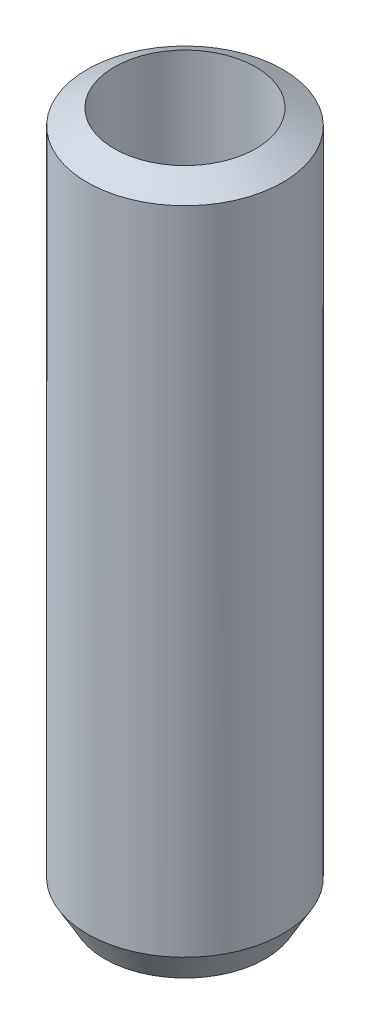
ISO-10303-21;
HEADER;
FILE_DESCRIPTION(('STEP AP214'),'2;1');
FILE_NAME('part.step','',(''),(''),'','','');
FILE_SCHEMA(('AUTOMOTIVE_DESIGN { 1 0 10303 214 1 1 1 1 }'));
ENDSEC;
DATA;
#1=APPLICATION_CONTEXT('core data for automotive mechanical design processes');
#2=APPLICATION_PROTOCOL_DEFINITION('international standard','automotive_design',2000,#1);
#3=PRODUCT_CONTEXT('',#1,'mechanical');
#4=PRODUCT('Part','Part','',(#3));
#5=PRODUCT_RELATED_PRODUCT_CATEGORY('part','',(#4));
#6=PRODUCT_DEFINITION_FORMATION('','',#4);
#7=PRODUCT_DEFINITION_CONTEXT('part definition',#1,'design');
#8=PRODUCT_DEFINITION('design','',#6,#7);
#9=PRODUCT_DEFINITION_SHAPE('','',#8);
#10=(LENGTH_UNIT() NAMED_UNIT(*) SI_UNIT(.MILLI.,.METRE.));
#11=(NAMED_UNIT(*) PLANE_ANGLE_UNIT() SI_UNIT($,.RADIAN.));
#12=(NAMED_UNIT(*) SI_UNIT($,.STERADIAN.) SOLID_ANGLE_UNIT());
#13=UNCERTAINTY_MEASURE_WITH_UNIT(LENGTH_MEASURE(1.E-05),#10,'distance_accuracy_value','');
#14=(GEOMETRIC_REPRESENTATION_CONTEXT(3) GLOBAL_UNCERTAINTY_ASSIGNED_CONTEXT((#13)) GLOBAL_UNIT_ASSIGNED_CONTEXT((#10,
#11,#12)) REPRESENTATION_CONTEXT('',''));
#15=CARTESIAN_POINT('',(0.,0.,0.));
#16=DIRECTION('',(0.,0.,1.));
#17=DIRECTION('',(1.,0.,0.));
#18=AXIS2_PLACEMENT_3D('',#15,#16,#17);
#19=CARTESIAN_POINT('',(0.,107.143663042607,0.));
#20=DIRECTION('',(0.,-1.,0.));
#21=DIRECTION('',(0.,0.,-1.));
#22=AXIS2_PLACEMENT_3D('',#19,#20,#21);
#23=CYLINDRICAL_SURFACE('',#22,15.);
#24=CARTESIAN_POINT('',(0.,104.449611344656,0.));
#25=DIRECTION('',(0.,1.,0.));
#26=DIRECTION('',(0.,0.,1.));
#27=AXIS2_PLACEMENT_3D('',#24,#25,#26);
#28=CIRCLE('',#27,15.);
#29=CARTESIAN_POINT('',(0.,104.449611344656,-15.));
#30=VERTEX_POINT('',#29);
#31=EDGE_CURVE('E50',#30,#30,#28,.F.);
#32=CARTESIAN_POINT('',(0.,4.66623441906867,0.));
#33=DIRECTION('',(0.,1.,0.));
#34=DIRECTION('',(0.,0.,1.));
#35=AXIS2_PLACEMENT_3D('',#32,#33,#34);
#36=CIRCLE('',#35,15.);
#37=CARTESIAN_POINT('',(0.,4.66623441906867,-15.));
#38=VERTEX_POINT('',#37);
#39=EDGE_CURVE('E51',#38,#38,#36,.T.);
#40=CARTESIAN_POINT('',(0.,104.449611344656,-15.));
#41=CARTESIAN_POINT('',(0.,103.410201168348,-15.));
#42=CARTESIAN_POINT('',(0.,102.37079099204,-15.));
#43=CARTESIAN_POINT('',(0.,100.291970639423,-15.));
#44=CARTESIAN_POINT('',(0.,99.2525604631151,-15.));
#45=CARTESIAN_POINT('',(0.,97.1737401104987,-15.));
#46=CARTESIAN_POINT('',(0.,96.1343299341905,-15.));
#47=CARTESIAN_POINT('',(0.,94.0555095815741,-15.));
#48=CARTESIAN_POINT('',(0.,93.0160994052659,-15.));
#49=CARTESIAN_POINT('',(0.,90.9372790526495,-15.));
#50=CARTESIAN_POINT('',(0.,89.8978688763413,-15.));
#51=CARTESIAN_POINT('',(0.,87.8190485237249,-15.));
#52=CARTESIAN_POINT('',(0.,86.7796383474167,-15.));
#53=CARTESIAN_POINT('',(0.,84.7008179948003,-15.));
#54=CARTESIAN_POINT('',(0.,83.6614078184921,-15.));
#55=CARTESIAN_POINT('',(0.,81.5825874658757,-15.));
#56=CARTESIAN_POINT('',(0.,80.5431772895675,-15.));
#57=CARTESIAN_POINT('',(0.,78.464356936951,-15.));
#58=CARTESIAN_POINT('',(0.,77.4249467606429,-15.));
#59=CARTESIAN_POINT('',(0.,75.3461264080264,-15.));
#60=CARTESIAN_POINT('',(0.,74.3067162317182,-15.));
#61=CARTESIAN_POINT('',(0.,72.2278958791019,-15.));
#62=CARTESIAN_POINT('',(0.,71.1884857027936,-15.));
#63=CARTESIAN_POINT('',(0.,69.1096653501772,-15.));
#64=CARTESIAN_POINT('',(0.,68.070255173869,-15.));
#65=CARTESIAN_POINT('',(0.,65.9914348212526,-15.));
#66=CARTESIAN_POINT('',(0.,64.9520246449444,-15.));
#67=CARTESIAN_POINT('',(0.,62.873204292328,-15.));
#68=CARTESIAN_POINT('',(0.,61.8337941160198,-15.));
#69=CARTESIAN_POINT('',(0.,59.7549737634034,-15.));
#70=CARTESIAN_POINT('',(0.,58.7155635870952,-15.));
#71=CARTESIAN_POINT('',(0.,56.6367432344788,-15.));
#72=CARTESIAN_POINT('',(0.,55.5973330581706,-15.));
#73=CARTESIAN_POINT('',(0.,53.5185127055542,-15.));
#74=CARTESIAN_POINT('',(0.,52.479102529246,-15.));
#75=CARTESIAN_POINT('',(0.,50.4002821766296,-15.));
#76=CARTESIAN_POINT('',(0.,49.3608720003214,-15.));
#77=CARTESIAN_POINT('',(0.,47.282051647705,-15.));
#78=CARTESIAN_POINT('',(0.,46.2426414713968,-15.));
#79=CARTESIAN_POINT('',(0.,44.1638211187804,-15.));
#80=CARTESIAN_POINT('',(0.,43.1244109424722,-15.));
#81=CARTESIAN_POINT('',(0.,41.0455905898558,-15.));
#82=CARTESIAN_POINT('',(0.,40.0061804135476,-15.));
#83=CARTESIAN_POINT('',(0.,37.9273600609312,-15.));
#84=CARTESIAN_POINT('',(0.,36.887949884623,-15.));
#85=CARTESIAN_POINT('',(0.,34.8091295320066,-15.));
#86=CARTESIAN_POINT('',(0.,33.7697193556983,-15.));
#87=CARTESIAN_POINT('',(0.,31.6908990030819,-15.));
#88=CARTESIAN_POINT('',(0.,30.6514888267737,-15.));
#89=CARTESIAN_POINT('',(0.,28.5726684741573,-15.));
#90=CARTESIAN_POINT('',(0.,27.5332582978491,-15.));
#91=CARTESIAN_POINT('',(0.,25.4544379452327,-15.));
#92=CARTESIAN_POINT('',(0.,24.4150277689245,-15.));
#93=CARTESIAN_POINT('',(0.,22.3362074163081,-15.));
#94=CARTESIAN_POINT('',(0.,21.2967972399999,-15.));
#95=CARTESIAN_POINT('',(0.,19.2179768873835,-15.));
#96=CARTESIAN_POINT('',(0.,18.1785667110753,-15.));
#97=CARTESIAN_POINT('',(0.,16.0997463584589,-15.));
#98=CARTESIAN_POINT('',(0.,15.0603361821507,-15.));
#99=CARTESIAN_POINT('',(0.,12.9815158295343,-15.));
#100=CARTESIAN_POINT('',(0.,11.9421056532261,-15.));
#101=CARTESIAN_POINT('',(0.,9.8632853006097,-15.));
#102=CARTESIAN_POINT('',(0.,8.8238751243015,-15.));
#103=CARTESIAN_POINT('',(0.,6.74505477168509,-15.));
#104=CARTESIAN_POINT('',(0.,5.70564459537688,-15.));
#105=CARTESIAN_POINT('',(0.,4.66623441906867,-15.));
#106=B_SPLINE_CURVE_WITH_KNOTS('',3,(#40,#41,#42,#43,#44,#45,#46,#47,#48,#49,#50,#51,#52,#53,
#54,#55,#56,#57,#58,#59,#60,#61,#62,#63,#64,#65,#66,#67,#68,#69,#70,#71,#72,#73,#74,#75,#76,#77,
#78,#79,#80,#81,#82,#83,#84,#85,#86,#87,#88,#89,#90,#91,#92,#93,#94,#95,#96,#97,#98,#99,#100,
#101,#102,#103,#104,#105),.UNSPECIFIED.,.F.,.F.,(4,2,2,2,2,2,2,2,2,2,2,2,2,2,2,2,2,2,2,2,2,2,2,
2,2,2,2,2,2,2,2,2,4),(0.,3.11823052892461,6.23646105784922,9.35469158677382,12.4729221156984,
15.591152644623,18.7093831735476,21.8276137024723,24.9458442313969,28.0640747603215,
31.1823052892461,34.3005358181707,37.4187663470953,40.5369968760199,43.6552274049445,
46.7734579338691,49.8916884627937,53.0099189917183,56.1281495206429,59.2463800495675,
62.3646105784922,65.4828411074168,68.6010716363414,71.719302165266,74.8375326941906,
77.9557632231152,81.0739937520398,84.1922242809644,87.310454809889,90.4286853388136,
93.5469158677382,96.6651463966628,99.7833769255874),.UNSPECIFIED.);
#107=EDGE_CURVE('BSEAM39',#30,#38,#106,.T.);
#108=ORIENTED_EDGE('',*,*,#31,.T.);
#109=ORIENTED_EDGE('',*,*,#39,.T.);
#110=ORIENTED_EDGE('',*,*,#107,.T.);
#111=ORIENTED_EDGE('',*,*,#107,.F.);
#112=EDGE_LOOP('',(#108,#110,#109,#111));
#113=FACE_BOUND('',#112,.T.);
#114=ADVANCED_FACE('F39',(#113),#23,.T.);
#115=CARTESIAN_POINT('',(0.,0.,0.));
#116=DIRECTION('',(0.,1.,0.));
#117=DIRECTION('',(0.,0.,1.));
#118=AXIS2_PLACEMENT_3D('',#115,#116,#117);
#119=PLANE('',#118);
#120=CARTESIAN_POINT('',(0.,0.,0.));
#121=DIRECTION('',(0.,1.,0.));
#122=DIRECTION('',(0.,0.,1.));
#123=AXIS2_PLACEMENT_3D('',#120,#121,#122);
#124=CIRCLE('',#123,12.3059483020488);
#125=CARTESIAN_POINT('',(0.,0.,12.3059483020488));
#126=VERTEX_POINT('',#125);
#127=EDGE_CURVE('E10',#126,#126,#124,.F.);
#128=ORIENTED_EDGE('',*,*,#127,.T.);
#129=EDGE_LOOP('',(#128));
#130=FACE_BOUND('',#129,.T.);
#131=CARTESIAN_POINT('',(0.,0.,0.));
#132=DIRECTION('',(0.,1.,0.));
#133=DIRECTION('',(0.,0.,1.));
#134=AXIS2_PLACEMENT_3D('',#131,#132,#133);
#135=CIRCLE('',#134,10.8521169036718);
#136=CARTESIAN_POINT('',(0.,0.,-10.8521169036718));
#137=VERTEX_POINT('',#136);
#138=EDGE_CURVE('E58',#137,#137,#135,.T.);
#139=ORIENTED_EDGE('',*,*,#138,.T.);
#140=EDGE_LOOP('',(#139));
#141=FACE_BOUND('',#140,.T.);
#142=ADVANCED_FACE('F62',(#130,#141),#119,.F.);
#143=CARTESIAN_POINT('',(0.,107.143663042607,0.));
#144=DIRECTION('',(0.,-1.,0.));
#145=DIRECTION('',(0.,0.,-1.));
#146=AXIS2_PLACEMENT_3D('',#143,#144,#145);
#147=CYLINDRICAL_SURFACE('',#146,10.8521169036718);
#148=CARTESIAN_POINT('',(0.,106.844392766888,0.));
#149=DIRECTION('',(0.,-1.,0.));
#150=DIRECTION('',(0.,0.,-1.));
#151=AXIS2_PLACEMENT_3D('',#148,#149,#150);
#152=CIRCLE('',#151,10.8521169036718);
#153=CARTESIAN_POINT('',(0.,106.844392766888,-10.8521169036718));
#154=VERTEX_POINT('',#153);
#155=EDGE_CURVE('E54',#154,#154,#152,.F.);
#156=CARTESIAN_POINT('',(0.,106.844392766888,-10.8521169036718));
#157=CARTESIAN_POINT('',(0.,105.731430342233,-10.8521169036718));
#158=CARTESIAN_POINT('',(0.,104.618467917578,-10.8521169036718));
#159=CARTESIAN_POINT('',(0.,102.392543068268,-10.8521169036718));
#160=CARTESIAN_POINT('',(0.,101.279580643613,-10.8521169036718));
#161=CARTESIAN_POINT('',(0.,99.0536557943027,-10.8521169036718));
#162=CARTESIAN_POINT('',(0.,97.9406933696476,-10.8521169036718));
#163=CARTESIAN_POINT('',(0.,95.7147685203375,-10.8521169036718));
#164=CARTESIAN_POINT('',(0.,94.6018060956824,-10.8521169036718));
#165=CARTESIAN_POINT('',(0.,92.3758812463722,-10.8521169036718));
#166=CARTESIAN_POINT('',(0.,91.2629188217171,-10.8521169036718));
#167=CARTESIAN_POINT('',(0.,89.0369939724069,-10.8521169036718));
#168=CARTESIAN_POINT('',(0.,87.9240315477518,-10.8521169036718));
#169=CARTESIAN_POINT('',(0.,85.6981066984417,-10.8521169036718));
#170=CARTESIAN_POINT('',(0.,84.5851442737866,-10.8521169036718));
#171=CARTESIAN_POINT('',(0.,82.3592194244764,-10.8521169036718));
#172=CARTESIAN_POINT('',(0.,81.2462569998213,-10.8521169036718));
#173=CARTESIAN_POINT('',(0.,79.0203321505112,-10.8521169036718));
#174=CARTESIAN_POINT('',(0.,77.9073697258561,-10.8521169036718));
#175=CARTESIAN_POINT('',(0.,75.6814448765459,-10.8521169036718));
#176=CARTESIAN_POINT('',(0.,74.5684824518908,-10.8521169036718));
#177=CARTESIAN_POINT('',(0.,72.3425576025806,-10.8521169036718));
#178=CARTESIAN_POINT('',(0.,71.2295951779255,-10.8521169036718));
#179=CARTESIAN_POINT('',(0.,69.0036703286154,-10.8521169036718));
#180=CARTESIAN_POINT('',(0.,67.8907079039603,-10.8521169036718));
#181=CARTESIAN_POINT('',(0.,65.6647830546501,-10.8521169036718));
#182=CARTESIAN_POINT('',(0.,64.551820629995,-10.8521169036718));
#183=CARTESIAN_POINT('',(0.,62.3258957806849,-10.8521169036718));
#184=CARTESIAN_POINT('',(0.,61.2129333560298,-10.8521169036718));
#185=CARTESIAN_POINT('',(0.,58.9870085067196,-10.8521169036718));
#186=CARTESIAN_POINT('',(0.,57.8740460820645,-10.8521169036718));
#187=CARTESIAN_POINT('',(0.,55.6481212327543,-10.8521169036718));
#188=CARTESIAN_POINT('',(0.,54.5351588080992,-10.8521169036718));
#189=CARTESIAN_POINT('',(0.,52.3092339587891,-10.8521169036718));
#190=CARTESIAN_POINT('',(0.,51.196271534134,-10.8521169036718));
#191=CARTESIAN_POINT('',(0.,48.9703466848238,-10.8521169036718));
#192=CARTESIAN_POINT('',(0.,47.8573842601687,-10.8521169036718));
#193=CARTESIAN_POINT('',(0.,45.6314594108585,-10.8521169036718));
#194=CARTESIAN_POINT('',(0.,44.5184969862035,-10.8521169036718));
#195=CARTESIAN_POINT('',(0.,42.2925721368933,-10.8521169036718));
#196=CARTESIAN_POINT('',(0.,41.1796097122382,-10.8521169036718));
#197=CARTESIAN_POINT('',(0.,38.953684862928,-10.8521169036718));
#198=CARTESIAN_POINT('',(0.,37.840722438273,-10.8521169036718));
#199=CARTESIAN_POINT('',(0.,35.6147975889628,-10.8521169036718));
#200=CARTESIAN_POINT('',(0.,34.5018351643077,-10.8521169036718));
#201=CARTESIAN_POINT('',(0.,32.2759103149975,-10.8521169036718));
#202=CARTESIAN_POINT('',(0.,31.1629478903424,-10.8521169036718));
#203=CARTESIAN_POINT('',(0.,28.9370230410323,-10.8521169036718));
#204=CARTESIAN_POINT('',(0.,27.8240606163772,-10.8521169036718));
#205=CARTESIAN_POINT('',(0.,25.598135767067,-10.8521169036718));
#206=CARTESIAN_POINT('',(0.,24.4851733424119,-10.8521169036718));
#207=CARTESIAN_POINT('',(0.,22.2592484931017,-10.8521169036718));
#208=CARTESIAN_POINT('',(0.,21.1462860684466,-10.8521169036718));
#209=CARTESIAN_POINT('',(0.,18.9203612191365,-10.8521169036718));
#210=CARTESIAN_POINT('',(0.,17.8073987944814,-10.8521169036718));
#211=CARTESIAN_POINT('',(0.,15.5814739451712,-10.8521169036718));
#212=CARTESIAN_POINT('',(0.,14.4685115205161,-10.8521169036718));
#213=CARTESIAN_POINT('',(0.,12.2425866712059,-10.8521169036718));
#214=CARTESIAN_POINT('',(0.,11.1296242465509,-10.8521169036718));
#215=CARTESIAN_POINT('',(0.,8.90369939724069,-10.8521169036718));
#216=CARTESIAN_POINT('',(0.,7.7907369725856,-10.8521169036718));
#217=CARTESIAN_POINT('',(0.,5.56481212327543,-10.8521169036718));
#218=CARTESIAN_POINT('',(0.,4.45184969862035,-10.8521169036718));
#219=CARTESIAN_POINT('',(0.,2.22592484931017,-10.8521169036718));
#220=CARTESIAN_POINT('',(0.,1.11296242465508,-10.8521169036718));
#221=CARTESIAN_POINT('',(0.,0.,-10.8521169036718));
#222=B_SPLINE_CURVE_WITH_KNOTS('',3,(#156,#157,#158,#159,#160,#161,#162,#163,#164,#165,#166,
#167,#168,#169,#170,#171,#172,#173,#174,#175,#176,#177,#178,#179,#180,#181,#182,#183,#184,#185,
#186,#187,#188,#189,#190,#191,#192,#193,#194,#195,#196,#197,#198,#199,#200,#201,#202,#203,#204,
#205,#206,#207,#208,#209,#210,#211,#212,#213,#214,#215,#216,#217,#218,#219,#220,#221),
.UNSPECIFIED.,.F.,.F.,(4,2,2,2,2,2,2,2,2,2,2,2,2,2,2,2,2,2,2,2,2,2,2,2,2,2,2,2,2,2,2,2,4),(0.,
3.33888727396527,6.67777454793053,10.0166618218958,13.355549095861,16.6944363698263,
20.0333236437916,23.3722109177568,26.7110981917221,30.0499854656873,33.3888727396526,
36.7277600136179,40.0666472875831,43.4055345615484,46.7444218355137,50.0833091094789,
53.4221963834442,56.7610836574094,60.0999709313747,63.43885820534,66.7777454793052,
70.1166327532705,73.4555200272357,76.794407301201,80.1332945751662,83.4721818491315,
86.8110691230968,90.149956397062,93.4888436710273,96.8277309449926,100.166618218958,
103.505505492923,106.844392766888),.UNSPECIFIED.);
#223=EDGE_CURVE('BSEAM68',#154,#137,#222,.T.);
#224=ORIENTED_EDGE('',*,*,#155,.T.);
#225=ORIENTED_EDGE('',*,*,#138,.F.);
#226=ORIENTED_EDGE('',*,*,#223,.T.);
#227=ORIENTED_EDGE('',*,*,#223,.F.);
#228=EDGE_LOOP('',(#224,#226,#225,#227));
#229=FACE_BOUND('',#228,.T.);
#230=ADVANCED_FACE('F68',(#229),#147,.F.);
#231=CARTESIAN_POINT('',(0.,107.143663042607,0.));
#232=DIRECTION('',(0.,-1.,0.));
#233=DIRECTION('',(0.,0.,-1.));
#234=AXIS2_PLACEMENT_3D('',#231,#232,#233);
#235=CONICAL_SURFACE('',#234,10.3337655809314,1.0471975511966);
#236=ORIENTED_EDGE('',*,*,#31,.F.);
#237=EDGE_LOOP('',(#236));
#238=FACE_BOUND('',#237,.T.);
#239=ORIENTED_EDGE('',*,*,#155,.F.);
#240=EDGE_LOOP('',(#239));
#241=FACE_BOUND('',#240,.T.);
#242=ADVANCED_FACE('F66',(#238,#241),#235,.T.);
#243=CARTESIAN_POINT('',(0.,4.66623441906867,0.));
#244=DIRECTION('',(0.,1.,0.));
#245=DIRECTION('',(0.,0.,1.));
#246=AXIS2_PLACEMENT_3D('',#243,#244,#245);
#247=CONICAL_SURFACE('',#246,15.,0.523598775598302);
#248=ORIENTED_EDGE('',*,*,#127,.F.);
#249=EDGE_LOOP('',(#248));
#250=FACE_BOUND('',#249,.T.);
#251=ORIENTED_EDGE('',*,*,#39,.F.);
#252=EDGE_LOOP('',(#251));
#253=FACE_BOUND('',#252,.T.);
#254=ADVANCED_FACE('F45',(#250,#253),#247,.T.);
#255=CLOSED_SHELL('',(#114,#142,#230,#242,#254));
#256=MANIFOLD_SOLID_BREP('B2',#255);
#257=ADVANCED_BREP_SHAPE_REPRESENTATION('',(#18,#256),#14);
#258=SHAPE_DEFINITION_REPRESENTATION(#9,#257);
ENDSEC;
END-ISO-10303-21;
